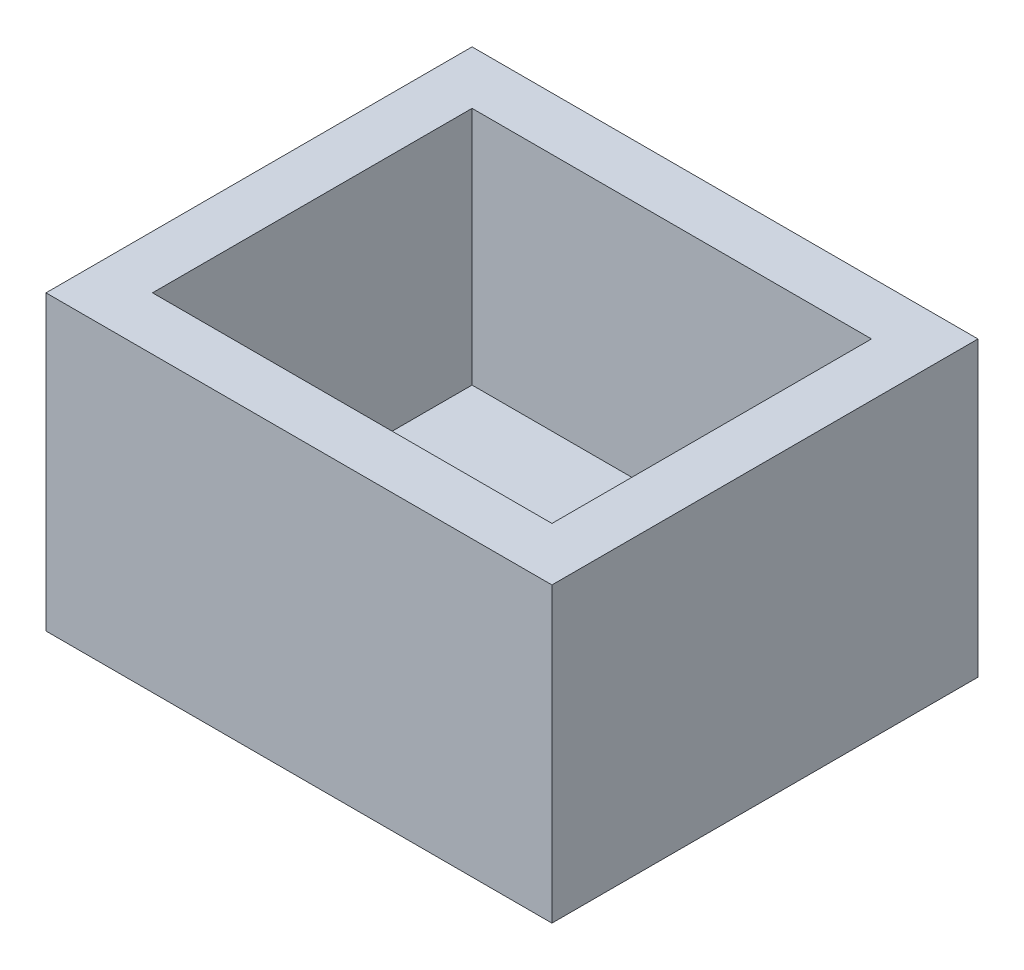
ISO-10303-21;
HEADER;
FILE_DESCRIPTION(('STEP AP214'),'2;1');
FILE_NAME('part.step','',(''),(''),'','','');
FILE_SCHEMA(('AUTOMOTIVE_DESIGN { 1 0 10303 214 1 1 1 1 }'));
ENDSEC;
DATA;
#1=APPLICATION_CONTEXT('core data for automotive mechanical design processes');
#2=APPLICATION_PROTOCOL_DEFINITION('international standard','automotive_design',2000,#1);
#3=PRODUCT_CONTEXT('',#1,'mechanical');
#4=PRODUCT('Part','Part','',(#3));
#5=PRODUCT_RELATED_PRODUCT_CATEGORY('part','',(#4));
#6=PRODUCT_DEFINITION_FORMATION('','',#4);
#7=PRODUCT_DEFINITION_CONTEXT('part definition',#1,'design');
#8=PRODUCT_DEFINITION('design','',#6,#7);
#9=PRODUCT_DEFINITION_SHAPE('','',#8);
#10=(LENGTH_UNIT() NAMED_UNIT(*) SI_UNIT(.MILLI.,.METRE.));
#11=(NAMED_UNIT(*) PLANE_ANGLE_UNIT() SI_UNIT($,.RADIAN.));
#12=(NAMED_UNIT(*) SI_UNIT($,.STERADIAN.) SOLID_ANGLE_UNIT());
#13=UNCERTAINTY_MEASURE_WITH_UNIT(LENGTH_MEASURE(1.E-05),#10,'distance_accuracy_value','');
#14=(GEOMETRIC_REPRESENTATION_CONTEXT(3) GLOBAL_UNCERTAINTY_ASSIGNED_CONTEXT((#13)) GLOBAL_UNIT_ASSIGNED_CONTEXT((#10,
#11,#12)) REPRESENTATION_CONTEXT('',''));
#15=CARTESIAN_POINT('',(0.,0.,0.));
#16=DIRECTION('',(0.,0.,1.));
#17=DIRECTION('',(1.,0.,0.));
#18=AXIS2_PLACEMENT_3D('',#15,#16,#17);
#19=CARTESIAN_POINT('',(0.,11.,0.));
#20=DIRECTION('',(0.,-1.,0.));
#21=DIRECTION('',(0.,0.,-1.));
#22=AXIS2_PLACEMENT_3D('',#19,#20,#21);
#23=PLANE('',#22);
#24=DIRECTION('',(0.,0.,1.));
#25=VECTOR('',#24,1.);
#26=CARTESIAN_POINT('',(0.,11.,0.));
#27=LINE('',#26,#25);
#28=CARTESIAN_POINT('',(0.,11.,-16.));
#29=VERTEX_POINT('',#28);
#30=CARTESIAN_POINT('',(0.,11.,0.));
#31=VERTEX_POINT('',#30);
#32=EDGE_CURVE('E161',#29,#31,#27,.T.);
#33=ORIENTED_EDGE('',*,*,#32,.T.);
#34=DIRECTION('',(1.,0.,0.));
#35=VECTOR('',#34,1.);
#36=CARTESIAN_POINT('',(0.,11.,0.));
#37=LINE('',#36,#35);
#38=CARTESIAN_POINT('',(19.,11.,0.));
#39=VERTEX_POINT('',#38);
#40=EDGE_CURVE('E96',#31,#39,#37,.T.);
#41=ORIENTED_EDGE('',*,*,#40,.T.);
#42=DIRECTION('',(0.,0.,-1.));
#43=VECTOR('',#42,1.);
#44=CARTESIAN_POINT('',(19.,11.,0.));
#45=LINE('',#44,#43);
#46=CARTESIAN_POINT('',(19.,11.,-16.));
#47=VERTEX_POINT('',#46);
#48=EDGE_CURVE('E166',#39,#47,#45,.T.);
#49=ORIENTED_EDGE('',*,*,#48,.T.);
#50=DIRECTION('',(-1.,0.,0.));
#51=VECTOR('',#50,1.);
#52=CARTESIAN_POINT('',(0.,11.,-16.));
#53=LINE('',#52,#51);
#54=EDGE_CURVE('E68',#47,#29,#53,.T.);
#55=ORIENTED_EDGE('',*,*,#54,.T.);
#56=EDGE_LOOP('',(#33,#41,#49,#55));
#57=FACE_BOUND('',#56,.T.);
#58=DIRECTION('',(0.,0.,1.));
#59=VECTOR('',#58,1.);
#60=CARTESIAN_POINT('',(2.,11.,0.));
#61=LINE('',#60,#59);
#62=CARTESIAN_POINT('',(2.,11.,-14.));
#63=VERTEX_POINT('',#62);
#64=CARTESIAN_POINT('',(2.,11.,-2.));
#65=VERTEX_POINT('',#64);
#66=EDGE_CURVE('E145',#63,#65,#61,.T.);
#67=ORIENTED_EDGE('',*,*,#66,.F.);
#68=DIRECTION('',(-1.,0.,0.));
#69=VECTOR('',#68,1.);
#70=CARTESIAN_POINT('',(0.,11.,-14.));
#71=LINE('',#70,#69);
#72=CARTESIAN_POINT('',(17.,11.,-14.));
#73=VERTEX_POINT('',#72);
#74=EDGE_CURVE('E158',#73,#63,#71,.T.);
#75=ORIENTED_EDGE('',*,*,#74,.F.);
#76=DIRECTION('',(0.,0.,-1.));
#77=VECTOR('',#76,1.);
#78=CARTESIAN_POINT('',(17.,11.,0.));
#79=LINE('',#78,#77);
#80=CARTESIAN_POINT('',(17.,11.,-2.));
#81=VERTEX_POINT('',#80);
#82=EDGE_CURVE('E155',#81,#73,#79,.T.);
#83=ORIENTED_EDGE('',*,*,#82,.F.);
#84=DIRECTION('',(1.,0.,0.));
#85=VECTOR('',#84,1.);
#86=CARTESIAN_POINT('',(0.,11.,-2.));
#87=LINE('',#86,#85);
#88=EDGE_CURVE('E134',#65,#81,#87,.T.);
#89=ORIENTED_EDGE('',*,*,#88,.F.);
#90=EDGE_LOOP('',(#67,#75,#83,#89));
#91=FACE_BOUND('',#90,.T.);
#92=ADVANCED_FACE('F43',(#57,#91),#23,.F.);
#93=CARTESIAN_POINT('',(0.,11.,0.));
#94=DIRECTION('',(1.,0.,0.));
#95=DIRECTION('',(0.,0.,-1.));
#96=AXIS2_PLACEMENT_3D('',#93,#94,#95);
#97=PLANE('',#96);
#98=DIRECTION('',(0.,0.,1.));
#99=VECTOR('',#98,1.);
#100=CARTESIAN_POINT('',(0.,0.,0.));
#101=LINE('',#100,#99);
#102=CARTESIAN_POINT('',(0.,0.,-16.));
#103=VERTEX_POINT('',#102);
#104=CARTESIAN_POINT('',(0.,0.,0.));
#105=VERTEX_POINT('',#104);
#106=EDGE_CURVE('E172',#103,#105,#101,.T.);
#107=ORIENTED_EDGE('',*,*,#106,.T.);
#108=DIRECTION('',(0.,-1.,0.));
#109=VECTOR('',#108,1.);
#110=CARTESIAN_POINT('',(0.,11.,0.));
#111=LINE('',#110,#109);
#112=EDGE_CURVE('E11',#31,#105,#111,.T.);
#113=ORIENTED_EDGE('',*,*,#112,.F.);
#114=ORIENTED_EDGE('',*,*,#32,.F.);
#115=DIRECTION('',(0.,-1.,0.));
#116=VECTOR('',#115,1.);
#117=CARTESIAN_POINT('',(0.,11.,-16.));
#118=LINE('',#117,#116);
#119=EDGE_CURVE('E171',#29,#103,#118,.T.);
#120=ORIENTED_EDGE('',*,*,#119,.T.);
#121=EDGE_LOOP('',(#107,#113,#114,#120));
#122=FACE_BOUND('',#121,.T.);
#123=ADVANCED_FACE('F45',(#122),#97,.F.);
#124=CARTESIAN_POINT('',(0.,11.,0.));
#125=DIRECTION('',(0.,0.,-1.));
#126=DIRECTION('',(-1.,0.,0.));
#127=AXIS2_PLACEMENT_3D('',#124,#125,#126);
#128=PLANE('',#127);
#129=DIRECTION('',(1.,0.,0.));
#130=VECTOR('',#129,1.);
#131=CARTESIAN_POINT('',(0.,0.,0.));
#132=LINE('',#131,#130);
#133=CARTESIAN_POINT('',(19.,0.,0.));
#134=VERTEX_POINT('',#133);
#135=EDGE_CURVE('E176',#105,#134,#132,.T.);
#136=ORIENTED_EDGE('',*,*,#135,.T.);
#137=DIRECTION('',(0.,-1.,0.));
#138=VECTOR('',#137,1.);
#139=CARTESIAN_POINT('',(19.,11.,0.));
#140=LINE('',#139,#138);
#141=EDGE_CURVE('E52',#39,#134,#140,.T.);
#142=ORIENTED_EDGE('',*,*,#141,.F.);
#143=ORIENTED_EDGE('',*,*,#40,.F.);
#144=ORIENTED_EDGE('',*,*,#112,.T.);
#145=EDGE_LOOP('',(#136,#142,#143,#144));
#146=FACE_BOUND('',#145,.T.);
#147=ADVANCED_FACE('F211',(#146),#128,.F.);
#148=CARTESIAN_POINT('',(19.,11.,0.));
#149=DIRECTION('',(-1.,0.,0.));
#150=DIRECTION('',(0.,0.,1.));
#151=AXIS2_PLACEMENT_3D('',#148,#149,#150);
#152=PLANE('',#151);
#153=DIRECTION('',(0.,0.,-1.));
#154=VECTOR('',#153,1.);
#155=CARTESIAN_POINT('',(19.,0.,0.));
#156=LINE('',#155,#154);
#157=CARTESIAN_POINT('',(19.,0.,-16.));
#158=VERTEX_POINT('',#157);
#159=EDGE_CURVE('E179',#134,#158,#156,.T.);
#160=ORIENTED_EDGE('',*,*,#159,.T.);
#161=DIRECTION('',(0.,-1.,0.));
#162=VECTOR('',#161,1.);
#163=CARTESIAN_POINT('',(19.,11.,-16.));
#164=LINE('',#163,#162);
#165=EDGE_CURVE('E186',#47,#158,#164,.T.);
#166=ORIENTED_EDGE('',*,*,#165,.F.);
#167=ORIENTED_EDGE('',*,*,#48,.F.);
#168=ORIENTED_EDGE('',*,*,#141,.T.);
#169=EDGE_LOOP('',(#160,#166,#167,#168));
#170=FACE_BOUND('',#169,.T.);
#171=ADVANCED_FACE('F193',(#170),#152,.F.);
#172=CARTESIAN_POINT('',(0.,11.,-16.));
#173=DIRECTION('',(0.,0.,1.));
#174=DIRECTION('',(1.,0.,0.));
#175=AXIS2_PLACEMENT_3D('',#172,#173,#174);
#176=PLANE('',#175);
#177=DIRECTION('',(-1.,0.,0.));
#178=VECTOR('',#177,1.);
#179=CARTESIAN_POINT('',(0.,0.,-16.));
#180=LINE('',#179,#178);
#181=EDGE_CURVE('E89',#158,#103,#180,.T.);
#182=ORIENTED_EDGE('',*,*,#181,.T.);
#183=ORIENTED_EDGE('',*,*,#119,.F.);
#184=ORIENTED_EDGE('',*,*,#54,.F.);
#185=ORIENTED_EDGE('',*,*,#165,.T.);
#186=EDGE_LOOP('',(#182,#183,#184,#185));
#187=FACE_BOUND('',#186,.T.);
#188=ADVANCED_FACE('F201',(#187),#176,.F.);
#189=CARTESIAN_POINT('',(0.,0.,0.));
#190=DIRECTION('',(0.,-1.,0.));
#191=DIRECTION('',(0.,0.,-1.));
#192=AXIS2_PLACEMENT_3D('',#189,#190,#191);
#193=PLANE('',#192);
#194=CARTESIAN_POINT('',(16.0256848319274,0.,-11.7780073823808));
#195=DIRECTION('',(0.,-1.,0.));
#196=DIRECTION('',(0.,0.,-1.));
#197=AXIS2_PLACEMENT_3D('',#194,#195,#196);
#198=CIRCLE('',#197,0.624999999999999);
#199=CARTESIAN_POINT('',(16.0256848319274,0.,-12.4030073823808));
#200=VERTEX_POINT('',#199);
#201=EDGE_CURVE('E249',#200,#200,#198,.T.);
#202=ORIENTED_EDGE('',*,*,#201,.F.);
#203=EDGE_LOOP('',(#202));
#204=FACE_BOUND('',#203,.T.);
#205=CARTESIAN_POINT('',(16.0256848319274,0.,-6.69800738238077));
#206=DIRECTION('',(0.,-1.,0.));
#207=DIRECTION('',(0.,0.,-1.));
#208=AXIS2_PLACEMENT_3D('',#205,#206,#207);
#209=CIRCLE('',#208,0.625000000000002);
#210=CARTESIAN_POINT('',(16.0256848319274,0.,-7.32300738238078));
#211=VERTEX_POINT('',#210);
#212=EDGE_CURVE('E260',#211,#211,#209,.T.);
#213=ORIENTED_EDGE('',*,*,#212,.F.);
#214=EDGE_LOOP('',(#213));
#215=FACE_BOUND('',#214,.T.);
#216=CARTESIAN_POINT('',(16.0256848319274,0.,-4.15800738238077));
#217=DIRECTION('',(0.,-1.,0.));
#218=DIRECTION('',(0.,0.,-1.));
#219=AXIS2_PLACEMENT_3D('',#216,#217,#218);
#220=CIRCLE('',#219,0.624999999999999);
#221=CARTESIAN_POINT('',(16.0256848319274,0.,-4.78300738238077));
#222=VERTEX_POINT('',#221);
#223=EDGE_CURVE('E254',#222,#222,#220,.T.);
#224=ORIENTED_EDGE('',*,*,#223,.F.);
#225=EDGE_LOOP('',(#224));
#226=FACE_BOUND('',#225,.T.);
#227=ORIENTED_EDGE('',*,*,#106,.F.);
#228=ORIENTED_EDGE('',*,*,#181,.F.);
#229=ORIENTED_EDGE('',*,*,#159,.F.);
#230=ORIENTED_EDGE('',*,*,#135,.F.);
#231=EDGE_LOOP('',(#227,#228,#229,#230));
#232=FACE_BOUND('',#231,.T.);
#233=ADVANCED_FACE('F197',(#204,#215,#226,#232),#193,.T.);
#234=CARTESIAN_POINT('',(2.,11.,0.));
#235=DIRECTION('',(1.,0.,0.));
#236=DIRECTION('',(0.,0.,-1.));
#237=AXIS2_PLACEMENT_3D('',#234,#235,#236);
#238=PLANE('',#237);
#239=DIRECTION('',(0.,0.,1.));
#240=VECTOR('',#239,1.);
#241=CARTESIAN_POINT('',(2.,2.,0.));
#242=LINE('',#241,#240);
#243=CARTESIAN_POINT('',(2.,2.,-14.));
#244=VERTEX_POINT('',#243);
#245=CARTESIAN_POINT('',(2.,2.,-2.));
#246=VERTEX_POINT('',#245);
#247=EDGE_CURVE('E124',#244,#246,#242,.T.);
#248=ORIENTED_EDGE('',*,*,#247,.F.);
#249=DIRECTION('',(0.,-1.,0.));
#250=VECTOR('',#249,1.);
#251=CARTESIAN_POINT('',(2.,11.,-14.));
#252=LINE('',#251,#250);
#253=EDGE_CURVE('E149',#63,#244,#252,.T.);
#254=ORIENTED_EDGE('',*,*,#253,.F.);
#255=ORIENTED_EDGE('',*,*,#66,.T.);
#256=DIRECTION('',(0.,-1.,0.));
#257=VECTOR('',#256,1.);
#258=CARTESIAN_POINT('',(2.,11.,-2.));
#259=LINE('',#258,#257);
#260=EDGE_CURVE('E138',#65,#246,#259,.T.);
#261=ORIENTED_EDGE('',*,*,#260,.T.);
#262=EDGE_LOOP('',(#248,#254,#255,#261));
#263=FACE_BOUND('',#262,.T.);
#264=ADVANCED_FACE('F208',(#263),#238,.T.);
#265=CARTESIAN_POINT('',(0.,11.,-2.));
#266=DIRECTION('',(0.,0.,-1.));
#267=DIRECTION('',(-1.,0.,0.));
#268=AXIS2_PLACEMENT_3D('',#265,#266,#267);
#269=PLANE('',#268);
#270=DIRECTION('',(1.,0.,0.));
#271=VECTOR('',#270,1.);
#272=CARTESIAN_POINT('',(0.,2.,-2.));
#273=LINE('',#272,#271);
#274=CARTESIAN_POINT('',(17.,2.,-2.));
#275=VERTEX_POINT('',#274);
#276=EDGE_CURVE('E118',#246,#275,#273,.T.);
#277=ORIENTED_EDGE('',*,*,#276,.F.);
#278=ORIENTED_EDGE('',*,*,#260,.F.);
#279=ORIENTED_EDGE('',*,*,#88,.T.);
#280=DIRECTION('',(0.,-1.,0.));
#281=VECTOR('',#280,1.);
#282=CARTESIAN_POINT('',(17.,11.,-2.));
#283=LINE('',#282,#281);
#284=EDGE_CURVE('E131',#81,#275,#283,.T.);
#285=ORIENTED_EDGE('',*,*,#284,.T.);
#286=EDGE_LOOP('',(#277,#278,#279,#285));
#287=FACE_BOUND('',#286,.T.);
#288=ADVANCED_FACE('F132',(#287),#269,.T.);
#289=CARTESIAN_POINT('',(17.,11.,0.));
#290=DIRECTION('',(-1.,0.,0.));
#291=DIRECTION('',(0.,0.,1.));
#292=AXIS2_PLACEMENT_3D('',#289,#290,#291);
#293=PLANE('',#292);
#294=DIRECTION('',(0.,0.,-1.));
#295=VECTOR('',#294,1.);
#296=CARTESIAN_POINT('',(17.,2.,0.));
#297=LINE('',#296,#295);
#298=CARTESIAN_POINT('',(17.,2.,-14.));
#299=VERTEX_POINT('',#298);
#300=EDGE_CURVE('E122',#275,#299,#297,.T.);
#301=ORIENTED_EDGE('',*,*,#300,.F.);
#302=ORIENTED_EDGE('',*,*,#284,.F.);
#303=ORIENTED_EDGE('',*,*,#82,.T.);
#304=DIRECTION('',(0.,-1.,0.));
#305=VECTOR('',#304,1.);
#306=CARTESIAN_POINT('',(17.,11.,-14.));
#307=LINE('',#306,#305);
#308=EDGE_CURVE('E59',#73,#299,#307,.T.);
#309=ORIENTED_EDGE('',*,*,#308,.T.);
#310=EDGE_LOOP('',(#301,#302,#303,#309));
#311=FACE_BOUND('',#310,.T.);
#312=ADVANCED_FACE('F140',(#311),#293,.T.);
#313=CARTESIAN_POINT('',(0.,11.,-14.));
#314=DIRECTION('',(0.,0.,1.));
#315=DIRECTION('',(1.,0.,0.));
#316=AXIS2_PLACEMENT_3D('',#313,#314,#315);
#317=PLANE('',#316);
#318=DIRECTION('',(-1.,0.,0.));
#319=VECTOR('',#318,1.);
#320=CARTESIAN_POINT('',(0.,2.,-14.));
#321=LINE('',#320,#319);
#322=EDGE_CURVE('E142',#299,#244,#321,.T.);
#323=ORIENTED_EDGE('',*,*,#322,.F.);
#324=ORIENTED_EDGE('',*,*,#308,.F.);
#325=ORIENTED_EDGE('',*,*,#74,.T.);
#326=ORIENTED_EDGE('',*,*,#253,.T.);
#327=EDGE_LOOP('',(#323,#324,#325,#326));
#328=FACE_BOUND('',#327,.T.);
#329=ADVANCED_FACE('F223',(#328),#317,.T.);
#330=CARTESIAN_POINT('',(0.,2.,0.));
#331=DIRECTION('',(0.,-1.,0.));
#332=DIRECTION('',(0.,0.,-1.));
#333=AXIS2_PLACEMENT_3D('',#330,#331,#332);
#334=PLANE('',#333);
#335=CARTESIAN_POINT('',(16.0256848319274,2.,-11.7780073823808));
#336=DIRECTION('',(0.,1.,0.));
#337=DIRECTION('',(0.,0.,1.));
#338=AXIS2_PLACEMENT_3D('',#335,#336,#337);
#339=CIRCLE('',#338,0.624999999999999);
#340=CARTESIAN_POINT('',(16.0256848319274,2.,-11.1530073823808));
#341=VERTEX_POINT('',#340);
#342=EDGE_CURVE('E252',#341,#341,#339,.T.);
#343=ORIENTED_EDGE('',*,*,#342,.F.);
#344=EDGE_LOOP('',(#343));
#345=FACE_BOUND('',#344,.T.);
#346=CARTESIAN_POINT('',(16.0256848319274,2.,-6.69800738238077));
#347=DIRECTION('',(0.,1.,0.));
#348=DIRECTION('',(0.,0.,1.));
#349=AXIS2_PLACEMENT_3D('',#346,#347,#348);
#350=CIRCLE('',#349,0.625000000000002);
#351=CARTESIAN_POINT('',(16.0256848319274,2.,-6.07300738238077));
#352=VERTEX_POINT('',#351);
#353=EDGE_CURVE('E255',#352,#352,#350,.T.);
#354=ORIENTED_EDGE('',*,*,#353,.F.);
#355=EDGE_LOOP('',(#354));
#356=FACE_BOUND('',#355,.T.);
#357=CARTESIAN_POINT('',(16.0256848319274,2.,-4.15800738238077));
#358=DIRECTION('',(0.,1.,0.));
#359=DIRECTION('',(0.,0.,1.));
#360=AXIS2_PLACEMENT_3D('',#357,#358,#359);
#361=CIRCLE('',#360,0.624999999999999);
#362=CARTESIAN_POINT('',(16.0256848319274,2.,-3.53300738238077));
#363=VERTEX_POINT('',#362);
#364=EDGE_CURVE('E263',#363,#363,#361,.T.);
#365=ORIENTED_EDGE('',*,*,#364,.F.);
#366=EDGE_LOOP('',(#365));
#367=FACE_BOUND('',#366,.T.);
#368=ORIENTED_EDGE('',*,*,#247,.T.);
#369=ORIENTED_EDGE('',*,*,#276,.T.);
#370=ORIENTED_EDGE('',*,*,#300,.T.);
#371=ORIENTED_EDGE('',*,*,#322,.T.);
#372=EDGE_LOOP('',(#368,#369,#370,#371));
#373=FACE_BOUND('',#372,.T.);
#374=ADVANCED_FACE('F120',(#345,#356,#367,#373),#334,.F.);
#375=CARTESIAN_POINT('',(16.0256848319274,-8.,-4.15800738238077));
#376=DIRECTION('',(0.,1.,0.));
#377=DIRECTION('',(0.,0.,1.));
#378=AXIS2_PLACEMENT_3D('',#375,#376,#377);
#379=CYLINDRICAL_SURFACE('',#378,0.624999999999999);
#380=ORIENTED_EDGE('',*,*,#223,.T.);
#381=EDGE_LOOP('',(#380));
#382=FACE_BOUND('',#381,.T.);
#383=ORIENTED_EDGE('',*,*,#364,.T.);
#384=EDGE_LOOP('',(#383));
#385=FACE_BOUND('',#384,.T.);
#386=ADVANCED_FACE('F222',(#382,#385),#379,.F.);
#387=CARTESIAN_POINT('',(16.0256848319274,-8.,-6.69800738238077));
#388=DIRECTION('',(0.,1.,0.));
#389=DIRECTION('',(0.,0.,1.));
#390=AXIS2_PLACEMENT_3D('',#387,#388,#389);
#391=CYLINDRICAL_SURFACE('',#390,0.625000000000002);
#392=ORIENTED_EDGE('',*,*,#212,.T.);
#393=EDGE_LOOP('',(#392));
#394=FACE_BOUND('',#393,.T.);
#395=ORIENTED_EDGE('',*,*,#353,.T.);
#396=EDGE_LOOP('',(#395));
#397=FACE_BOUND('',#396,.T.);
#398=ADVANCED_FACE('F236',(#394,#397),#391,.F.);
#399=CARTESIAN_POINT('',(16.0256848319274,-8.,-11.7780073823808));
#400=DIRECTION('',(0.,1.,0.));
#401=DIRECTION('',(0.,0.,1.));
#402=AXIS2_PLACEMENT_3D('',#399,#400,#401);
#403=CYLINDRICAL_SURFACE('',#402,0.624999999999999);
#404=ORIENTED_EDGE('',*,*,#201,.T.);
#405=EDGE_LOOP('',(#404));
#406=FACE_BOUND('',#405,.T.);
#407=ORIENTED_EDGE('',*,*,#342,.T.);
#408=EDGE_LOOP('',(#407));
#409=FACE_BOUND('',#408,.T.);
#410=ADVANCED_FACE('F240',(#406,#409),#403,.F.);
#411=CLOSED_SHELL('',(#92,#123,#147,#171,#188,#233,#264,#288,#312,#329,#374,#386,#398,#410));
#412=MANIFOLD_SOLID_BREP('B2',#411);
#413=ADVANCED_BREP_SHAPE_REPRESENTATION('',(#18,#412),#14);
#414=SHAPE_DEFINITION_REPRESENTATION(#9,#413);
ENDSEC;
END-ISO-10303-21;
